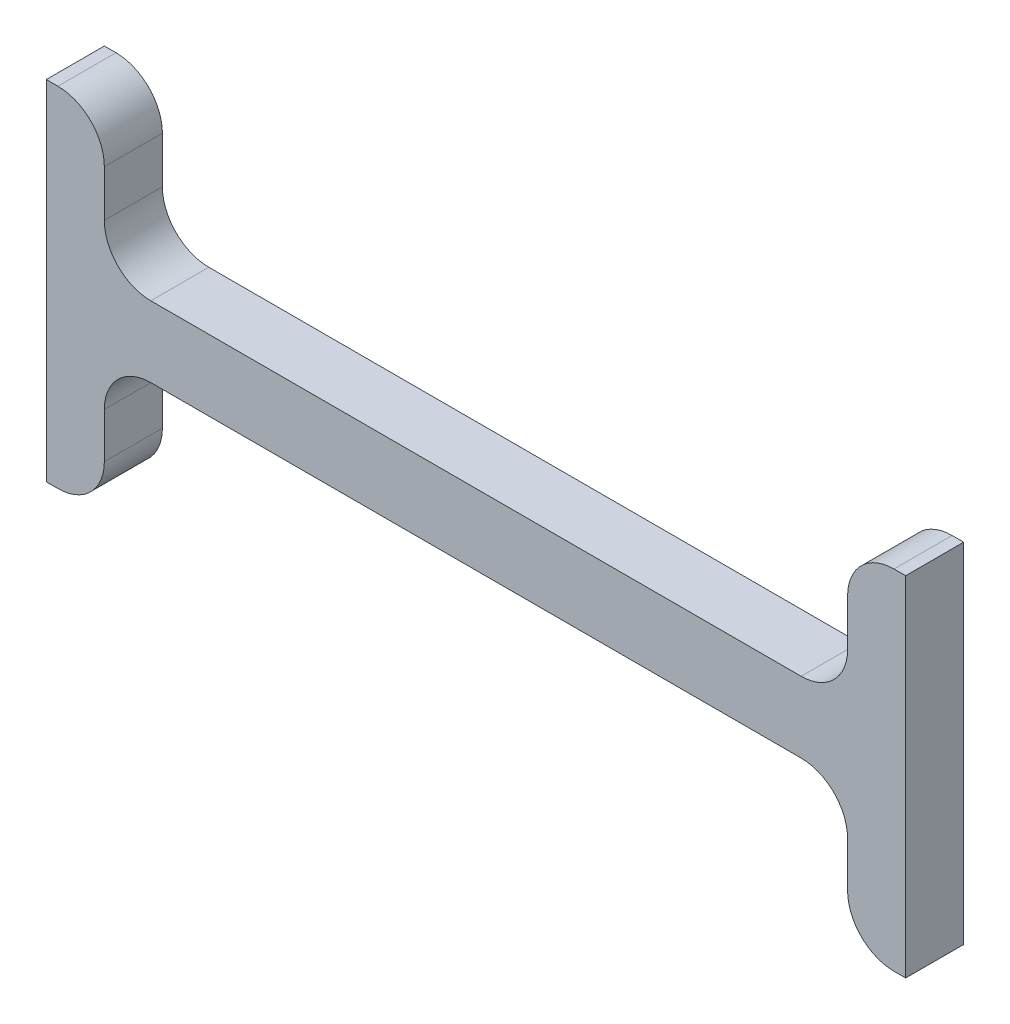
ISO-10303-21;
HEADER;
FILE_DESCRIPTION(('STEP AP214'),'2;1');
FILE_NAME('part.step','',(''),(''),'','','');
FILE_SCHEMA(('AUTOMOTIVE_DESIGN { 1 0 10303 214 1 1 1 1 }'));
ENDSEC;
DATA;
#1=APPLICATION_CONTEXT('core data for automotive mechanical design processes');
#2=APPLICATION_PROTOCOL_DEFINITION('international standard','automotive_design',2000,#1);
#3=PRODUCT_CONTEXT('',#1,'mechanical');
#4=PRODUCT('Part','Part','',(#3));
#5=PRODUCT_RELATED_PRODUCT_CATEGORY('part','',(#4));
#6=PRODUCT_DEFINITION_FORMATION('','',#4);
#7=PRODUCT_DEFINITION_CONTEXT('part definition',#1,'design');
#8=PRODUCT_DEFINITION('design','',#6,#7);
#9=PRODUCT_DEFINITION_SHAPE('','',#8);
#10=(LENGTH_UNIT() NAMED_UNIT(*) SI_UNIT(.MILLI.,.METRE.));
#11=(NAMED_UNIT(*) PLANE_ANGLE_UNIT() SI_UNIT($,.RADIAN.));
#12=(NAMED_UNIT(*) SI_UNIT($,.STERADIAN.) SOLID_ANGLE_UNIT());
#13=UNCERTAINTY_MEASURE_WITH_UNIT(LENGTH_MEASURE(1.E-05),#10,'distance_accuracy_value','');
#14=(GEOMETRIC_REPRESENTATION_CONTEXT(3) GLOBAL_UNCERTAINTY_ASSIGNED_CONTEXT((#13)) GLOBAL_UNIT_ASSIGNED_CONTEXT((#10,
#11,#12)) REPRESENTATION_CONTEXT('',''));
#15=CARTESIAN_POINT('',(0.,0.,0.));
#16=DIRECTION('',(0.,0.,1.));
#17=DIRECTION('',(1.,0.,0.));
#18=AXIS2_PLACEMENT_3D('',#15,#16,#17);
#19=CARTESIAN_POINT('',(1.26999999999996,0.,6.35));
#20=DIRECTION('',(0.,1.,0.));
#21=DIRECTION('',(0.,0.,1.));
#22=AXIS2_PLACEMENT_3D('',#19,#20,#21);
#23=PLANE('',#22);
#24=DIRECTION('',(1.,0.,0.));
#25=VECTOR('',#24,1.);
#26=CARTESIAN_POINT('',(1.26999999999996,0.,0.));
#27=LINE('',#26,#25);
#28=CARTESIAN_POINT('',(0.,0.,0.));
#29=VERTEX_POINT('',#28);
#30=CARTESIAN_POINT('',(1.26999999999997,0.,0.));
#31=VERTEX_POINT('',#30);
#32=EDGE_CURVE('E202',#29,#31,#27,.T.);
#33=ORIENTED_EDGE('',*,*,#32,.T.);
#34=DIRECTION('',(0.,0.,-1.));
#35=VECTOR('',#34,1.);
#36=CARTESIAN_POINT('',(1.26999999999997,0.,6.35));
#37=LINE('',#36,#35);
#38=CARTESIAN_POINT('',(1.26999999999997,0.,6.35));
#39=VERTEX_POINT('',#38);
#40=EDGE_CURVE('E11',#39,#31,#37,.T.);
#41=ORIENTED_EDGE('',*,*,#40,.F.);
#42=DIRECTION('',(1.,0.,0.));
#43=VECTOR('',#42,1.);
#44=CARTESIAN_POINT('',(1.26999999999996,0.,6.35));
#45=LINE('',#44,#43);
#46=CARTESIAN_POINT('',(0.,0.,6.35));
#47=VERTEX_POINT('',#46);
#48=EDGE_CURVE('E240',#47,#39,#45,.T.);
#49=ORIENTED_EDGE('',*,*,#48,.F.);
#50=DIRECTION('',(0.,0.,-1.));
#51=VECTOR('',#50,1.);
#52=CARTESIAN_POINT('',(0.,0.,6.35));
#53=LINE('',#52,#51);
#54=EDGE_CURVE('E198',#47,#29,#53,.T.);
#55=ORIENTED_EDGE('',*,*,#54,.T.);
#56=EDGE_LOOP('',(#33,#41,#49,#55));
#57=FACE_BOUND('',#56,.T.);
#58=ADVANCED_FACE('F34',(#57),#23,.F.);
#59=CARTESIAN_POINT('',(1.27,5.08,6.35));
#60=DIRECTION('',(0.,0.,-1.));
#61=DIRECTION('',(-1.,0.,0.));
#62=AXIS2_PLACEMENT_3D('',#59,#60,#61);
#63=CYLINDRICAL_SURFACE('',#62,5.08);
#64=CARTESIAN_POINT('',(1.27,5.08,0.));
#65=DIRECTION('',(0.,0.,1.));
#66=DIRECTION('',(-1.,0.,0.));
#67=AXIS2_PLACEMENT_3D('',#64,#65,#66);
#68=CIRCLE('',#67,5.08);
#69=CARTESIAN_POINT('',(6.35,5.08000000000003,0.));
#70=VERTEX_POINT('',#69);
#71=EDGE_CURVE('E205',#31,#70,#68,.T.);
#72=ORIENTED_EDGE('',*,*,#71,.T.);
#73=DIRECTION('',(0.,0.,-1.));
#74=VECTOR('',#73,1.);
#75=CARTESIAN_POINT('',(6.35,5.08000000000003,6.35));
#76=LINE('',#75,#74);
#77=CARTESIAN_POINT('',(6.35,5.08000000000003,6.35));
#78=VERTEX_POINT('',#77);
#79=EDGE_CURVE('E42',#78,#70,#76,.T.);
#80=ORIENTED_EDGE('',*,*,#79,.F.);
#81=CARTESIAN_POINT('',(1.27,5.08,6.35));
#82=DIRECTION('',(0.,0.,1.));
#83=DIRECTION('',(-1.,0.,0.));
#84=AXIS2_PLACEMENT_3D('',#81,#82,#83);
#85=CIRCLE('',#84,5.08);
#86=EDGE_CURVE('E129',#39,#78,#85,.T.);
#87=ORIENTED_EDGE('',*,*,#86,.F.);
#88=ORIENTED_EDGE('',*,*,#40,.T.);
#89=EDGE_LOOP('',(#72,#80,#87,#88));
#90=FACE_BOUND('',#89,.T.);
#91=ADVANCED_FACE('F358',(#90),#63,.T.);
#92=CARTESIAN_POINT('',(6.35,5.08000000000003,6.35));
#93=DIRECTION('',(-1.,0.,0.));
#94=DIRECTION('',(0.,0.,1.));
#95=AXIS2_PLACEMENT_3D('',#92,#93,#94);
#96=PLANE('',#95);
#97=DIRECTION('',(0.,1.,0.));
#98=VECTOR('',#97,1.);
#99=CARTESIAN_POINT('',(6.35,5.08000000000003,0.));
#100=LINE('',#99,#98);
#101=CARTESIAN_POINT('',(6.35,10.033,0.));
#102=VERTEX_POINT('',#101);
#103=EDGE_CURVE('E207',#70,#102,#100,.T.);
#104=ORIENTED_EDGE('',*,*,#103,.T.);
#105=DIRECTION('',(0.,0.,-1.));
#106=VECTOR('',#105,1.);
#107=CARTESIAN_POINT('',(6.35,10.033,6.35));
#108=LINE('',#107,#106);
#109=CARTESIAN_POINT('',(6.35,10.033,6.35));
#110=VERTEX_POINT('',#109);
#111=EDGE_CURVE('E283',#110,#102,#108,.T.);
#112=ORIENTED_EDGE('',*,*,#111,.F.);
#113=DIRECTION('',(0.,1.,0.));
#114=VECTOR('',#113,1.);
#115=CARTESIAN_POINT('',(6.35,5.08000000000003,6.35));
#116=LINE('',#115,#114);
#117=EDGE_CURVE('E291',#78,#110,#116,.T.);
#118=ORIENTED_EDGE('',*,*,#117,.F.);
#119=ORIENTED_EDGE('',*,*,#79,.T.);
#120=EDGE_LOOP('',(#104,#112,#118,#119));
#121=FACE_BOUND('',#120,.T.);
#122=ADVANCED_FACE('F289',(#121),#96,.F.);
#123=CARTESIAN_POINT('',(11.43,10.033,6.35));
#124=DIRECTION('',(0.,0.,-1.));
#125=DIRECTION('',(-1.,0.,0.));
#126=AXIS2_PLACEMENT_3D('',#123,#124,#125);
#127=CYLINDRICAL_SURFACE('',#126,5.08);
#128=CARTESIAN_POINT('',(11.43,10.033,0.));
#129=DIRECTION('',(0.,0.,-1.));
#130=DIRECTION('',(-1.,0.,0.));
#131=AXIS2_PLACEMENT_3D('',#128,#129,#130);
#132=CIRCLE('',#131,5.08);
#133=CARTESIAN_POINT('',(11.43,15.113,0.));
#134=VERTEX_POINT('',#133);
#135=EDGE_CURVE('E209',#102,#134,#132,.T.);
#136=ORIENTED_EDGE('',*,*,#135,.T.);
#137=DIRECTION('',(0.,0.,-1.));
#138=VECTOR('',#137,1.);
#139=CARTESIAN_POINT('',(11.43,15.113,6.35));
#140=LINE('',#139,#138);
#141=CARTESIAN_POINT('',(11.43,15.113,6.35));
#142=VERTEX_POINT('',#141);
#143=EDGE_CURVE('E280',#142,#134,#140,.T.);
#144=ORIENTED_EDGE('',*,*,#143,.F.);
#145=CARTESIAN_POINT('',(11.43,10.033,6.35));
#146=DIRECTION('',(0.,0.,-1.));
#147=DIRECTION('',(-1.,0.,0.));
#148=AXIS2_PLACEMENT_3D('',#145,#146,#147);
#149=CIRCLE('',#148,5.08);
#150=EDGE_CURVE('E309',#110,#142,#149,.T.);
#151=ORIENTED_EDGE('',*,*,#150,.F.);
#152=ORIENTED_EDGE('',*,*,#111,.T.);
#153=EDGE_LOOP('',(#136,#144,#151,#152));
#154=FACE_BOUND('',#153,.T.);
#155=ADVANCED_FACE('F300',(#154),#127,.F.);
#156=CARTESIAN_POINT('',(11.43,15.113,6.35));
#157=DIRECTION('',(0.,1.,0.));
#158=DIRECTION('',(-1.,0.,0.));
#159=AXIS2_PLACEMENT_3D('',#156,#157,#158);
#160=PLANE('',#159);
#161=DIRECTION('',(1.,0.,0.));
#162=VECTOR('',#161,1.);
#163=CARTESIAN_POINT('',(11.43,15.113,0.));
#164=LINE('',#163,#162);
#165=CARTESIAN_POINT('',(82.55,15.113,0.));
#166=VERTEX_POINT('',#165);
#167=EDGE_CURVE('E211',#134,#166,#164,.T.);
#168=ORIENTED_EDGE('',*,*,#167,.T.);
#169=DIRECTION('',(0.,0.,-1.));
#170=VECTOR('',#169,1.);
#171=CARTESIAN_POINT('',(82.55,15.113,6.35));
#172=LINE('',#171,#170);
#173=CARTESIAN_POINT('',(82.55,15.113,6.35));
#174=VERTEX_POINT('',#173);
#175=EDGE_CURVE('E277',#174,#166,#172,.T.);
#176=ORIENTED_EDGE('',*,*,#175,.F.);
#177=DIRECTION('',(1.,0.,0.));
#178=VECTOR('',#177,1.);
#179=CARTESIAN_POINT('',(11.43,15.113,6.35));
#180=LINE('',#179,#178);
#181=EDGE_CURVE('E306',#142,#174,#180,.T.);
#182=ORIENTED_EDGE('',*,*,#181,.F.);
#183=ORIENTED_EDGE('',*,*,#143,.T.);
#184=EDGE_LOOP('',(#168,#176,#182,#183));
#185=FACE_BOUND('',#184,.T.);
#186=ADVANCED_FACE('F304',(#185),#160,.F.);
#187=CARTESIAN_POINT('',(82.55,10.033,6.35));
#188=DIRECTION('',(0.,0.,-1.));
#189=DIRECTION('',(-1.,0.,0.));
#190=AXIS2_PLACEMENT_3D('',#187,#188,#189);
#191=CYLINDRICAL_SURFACE('',#190,5.08);
#192=CARTESIAN_POINT('',(82.55,10.033,0.));
#193=DIRECTION('',(0.,0.,-1.));
#194=DIRECTION('',(1.,0.,0.));
#195=AXIS2_PLACEMENT_3D('',#192,#193,#194);
#196=CIRCLE('',#195,5.08);
#197=CARTESIAN_POINT('',(87.63,10.033,0.));
#198=VERTEX_POINT('',#197);
#199=EDGE_CURVE('E213',#166,#198,#196,.T.);
#200=ORIENTED_EDGE('',*,*,#199,.T.);
#201=DIRECTION('',(0.,0.,-1.));
#202=VECTOR('',#201,1.);
#203=CARTESIAN_POINT('',(87.63,10.033,6.35));
#204=LINE('',#203,#202);
#205=CARTESIAN_POINT('',(87.63,10.033,6.35));
#206=VERTEX_POINT('',#205);
#207=EDGE_CURVE('E274',#206,#198,#204,.T.);
#208=ORIENTED_EDGE('',*,*,#207,.F.);
#209=CARTESIAN_POINT('',(82.55,10.033,6.35));
#210=DIRECTION('',(0.,0.,-1.));
#211=DIRECTION('',(1.,0.,0.));
#212=AXIS2_PLACEMENT_3D('',#209,#210,#211);
#213=CIRCLE('',#212,5.08);
#214=EDGE_CURVE('E308',#174,#206,#213,.T.);
#215=ORIENTED_EDGE('',*,*,#214,.F.);
#216=ORIENTED_EDGE('',*,*,#175,.T.);
#217=EDGE_LOOP('',(#200,#208,#215,#216));
#218=FACE_BOUND('',#217,.T.);
#219=ADVANCED_FACE('F371',(#218),#191,.F.);
#220=CARTESIAN_POINT('',(87.63,5.08000000000004,6.35));
#221=DIRECTION('',(1.,0.,0.));
#222=DIRECTION('',(0.,0.,-1.));
#223=AXIS2_PLACEMENT_3D('',#220,#221,#222);
#224=PLANE('',#223);
#225=DIRECTION('',(0.,-1.,0.));
#226=VECTOR('',#225,1.);
#227=CARTESIAN_POINT('',(87.63,5.08000000000004,0.));
#228=LINE('',#227,#226);
#229=CARTESIAN_POINT('',(87.63,5.08000000000004,0.));
#230=VERTEX_POINT('',#229);
#231=EDGE_CURVE('E215',#198,#230,#228,.T.);
#232=ORIENTED_EDGE('',*,*,#231,.T.);
#233=DIRECTION('',(0.,0.,-1.));
#234=VECTOR('',#233,1.);
#235=CARTESIAN_POINT('',(87.63,5.08000000000004,6.35));
#236=LINE('',#235,#234);
#237=CARTESIAN_POINT('',(87.63,5.08000000000004,6.35));
#238=VERTEX_POINT('',#237);
#239=EDGE_CURVE('E271',#238,#230,#236,.T.);
#240=ORIENTED_EDGE('',*,*,#239,.F.);
#241=DIRECTION('',(0.,-1.,0.));
#242=VECTOR('',#241,1.);
#243=CARTESIAN_POINT('',(87.63,5.08000000000004,6.35));
#244=LINE('',#243,#242);
#245=EDGE_CURVE('E311',#206,#238,#244,.T.);
#246=ORIENTED_EDGE('',*,*,#245,.F.);
#247=ORIENTED_EDGE('',*,*,#207,.T.);
#248=EDGE_LOOP('',(#232,#240,#246,#247));
#249=FACE_BOUND('',#248,.T.);
#250=ADVANCED_FACE('F374',(#249),#224,.F.);
#251=CARTESIAN_POINT('',(92.71,5.08,6.35));
#252=DIRECTION('',(0.,0.,-1.));
#253=DIRECTION('',(-1.,0.,0.));
#254=AXIS2_PLACEMENT_3D('',#251,#252,#253);
#255=CYLINDRICAL_SURFACE('',#254,5.08);
#256=CARTESIAN_POINT('',(92.71,5.08,0.));
#257=DIRECTION('',(0.,0.,1.));
#258=DIRECTION('',(1.,0.,0.));
#259=AXIS2_PLACEMENT_3D('',#256,#257,#258);
#260=CIRCLE('',#259,5.08);
#261=CARTESIAN_POINT('',(92.7100000000001,0.,0.));
#262=VERTEX_POINT('',#261);
#263=EDGE_CURVE('E217',#230,#262,#260,.T.);
#264=ORIENTED_EDGE('',*,*,#263,.T.);
#265=DIRECTION('',(0.,0.,-1.));
#266=VECTOR('',#265,1.);
#267=CARTESIAN_POINT('',(92.7100000000001,0.,6.35));
#268=LINE('',#267,#266);
#269=CARTESIAN_POINT('',(92.7100000000001,0.,6.35));
#270=VERTEX_POINT('',#269);
#271=EDGE_CURVE('E268',#270,#262,#268,.T.);
#272=ORIENTED_EDGE('',*,*,#271,.F.);
#273=CARTESIAN_POINT('',(92.71,5.08,6.35));
#274=DIRECTION('',(0.,0.,1.));
#275=DIRECTION('',(1.,0.,0.));
#276=AXIS2_PLACEMENT_3D('',#273,#274,#275);
#277=CIRCLE('',#276,5.08);
#278=EDGE_CURVE('E317',#238,#270,#277,.T.);
#279=ORIENTED_EDGE('',*,*,#278,.F.);
#280=ORIENTED_EDGE('',*,*,#239,.T.);
#281=EDGE_LOOP('',(#264,#272,#279,#280));
#282=FACE_BOUND('',#281,.T.);
#283=ADVANCED_FACE('F378',(#282),#255,.T.);
#284=CARTESIAN_POINT('',(92.7100000000001,0.,6.35));
#285=DIRECTION('',(0.,1.,0.));
#286=DIRECTION('',(0.,0.,1.));
#287=AXIS2_PLACEMENT_3D('',#284,#285,#286);
#288=PLANE('',#287);
#289=DIRECTION('',(1.,0.,0.));
#290=VECTOR('',#289,1.);
#291=CARTESIAN_POINT('',(92.7100000000001,0.,0.));
#292=LINE('',#291,#290);
#293=CARTESIAN_POINT('',(93.98,0.,0.));
#294=VERTEX_POINT('',#293);
#295=EDGE_CURVE('E219',#262,#294,#292,.T.);
#296=ORIENTED_EDGE('',*,*,#295,.T.);
#297=DIRECTION('',(0.,0.,-1.));
#298=VECTOR('',#297,1.);
#299=CARTESIAN_POINT('',(93.98,0.,6.35));
#300=LINE('',#299,#298);
#301=CARTESIAN_POINT('',(93.98,0.,6.35));
#302=VERTEX_POINT('',#301);
#303=EDGE_CURVE('E265',#302,#294,#300,.T.);
#304=ORIENTED_EDGE('',*,*,#303,.F.);
#305=DIRECTION('',(1.,0.,0.));
#306=VECTOR('',#305,1.);
#307=CARTESIAN_POINT('',(92.7100000000001,0.,6.35));
#308=LINE('',#307,#306);
#309=EDGE_CURVE('E319',#270,#302,#308,.T.);
#310=ORIENTED_EDGE('',*,*,#309,.F.);
#311=ORIENTED_EDGE('',*,*,#271,.T.);
#312=EDGE_LOOP('',(#296,#304,#310,#311));
#313=FACE_BOUND('',#312,.T.);
#314=ADVANCED_FACE('F382',(#313),#288,.F.);
#315=CARTESIAN_POINT('',(93.98,0.,6.35));
#316=DIRECTION('',(-1.,0.,0.));
#317=DIRECTION('',(0.,0.,1.));
#318=AXIS2_PLACEMENT_3D('',#315,#316,#317);
#319=PLANE('',#318);
#320=DIRECTION('',(0.,1.,0.));
#321=VECTOR('',#320,1.);
#322=CARTESIAN_POINT('',(93.98,0.,0.));
#323=LINE('',#322,#321);
#324=CARTESIAN_POINT('',(93.98,38.1,0.));
#325=VERTEX_POINT('',#324);
#326=EDGE_CURVE('E221',#294,#325,#323,.T.);
#327=ORIENTED_EDGE('',*,*,#326,.T.);
#328=DIRECTION('',(0.,0.,-1.));
#329=VECTOR('',#328,1.);
#330=CARTESIAN_POINT('',(93.98,38.1,6.35));
#331=LINE('',#330,#329);
#332=CARTESIAN_POINT('',(93.98,38.1,6.35));
#333=VERTEX_POINT('',#332);
#334=EDGE_CURVE('E262',#333,#325,#331,.T.);
#335=ORIENTED_EDGE('',*,*,#334,.F.);
#336=DIRECTION('',(0.,1.,0.));
#337=VECTOR('',#336,1.);
#338=CARTESIAN_POINT('',(93.98,0.,6.35));
#339=LINE('',#338,#337);
#340=EDGE_CURVE('E321',#302,#333,#339,.T.);
#341=ORIENTED_EDGE('',*,*,#340,.F.);
#342=ORIENTED_EDGE('',*,*,#303,.T.);
#343=EDGE_LOOP('',(#327,#335,#341,#342));
#344=FACE_BOUND('',#343,.T.);
#345=ADVANCED_FACE('F386',(#344),#319,.F.);
#346=CARTESIAN_POINT('',(93.98,38.1,6.35));
#347=DIRECTION('',(0.,-1.,0.));
#348=DIRECTION('',(0.,0.,-1.));
#349=AXIS2_PLACEMENT_3D('',#346,#347,#348);
#350=PLANE('',#349);
#351=DIRECTION('',(-1.,0.,0.));
#352=VECTOR('',#351,1.);
#353=CARTESIAN_POINT('',(93.98,38.1,0.));
#354=LINE('',#353,#352);
#355=CARTESIAN_POINT('',(92.7100000000001,38.1,0.));
#356=VERTEX_POINT('',#355);
#357=EDGE_CURVE('E223',#325,#356,#354,.T.);
#358=ORIENTED_EDGE('',*,*,#357,.T.);
#359=DIRECTION('',(0.,0.,-1.));
#360=VECTOR('',#359,1.);
#361=CARTESIAN_POINT('',(92.7100000000001,38.1,6.35));
#362=LINE('',#361,#360);
#363=CARTESIAN_POINT('',(92.7100000000001,38.1,6.35));
#364=VERTEX_POINT('',#363);
#365=EDGE_CURVE('E259',#364,#356,#362,.T.);
#366=ORIENTED_EDGE('',*,*,#365,.F.);
#367=DIRECTION('',(-1.,0.,0.));
#368=VECTOR('',#367,1.);
#369=CARTESIAN_POINT('',(93.98,38.1,6.35));
#370=LINE('',#369,#368);
#371=EDGE_CURVE('E323',#333,#364,#370,.T.);
#372=ORIENTED_EDGE('',*,*,#371,.F.);
#373=ORIENTED_EDGE('',*,*,#334,.T.);
#374=EDGE_LOOP('',(#358,#366,#372,#373));
#375=FACE_BOUND('',#374,.T.);
#376=ADVANCED_FACE('F390',(#375),#350,.F.);
#377=CARTESIAN_POINT('',(92.71,33.02,6.35));
#378=DIRECTION('',(0.,0.,-1.));
#379=DIRECTION('',(-1.,0.,0.));
#380=AXIS2_PLACEMENT_3D('',#377,#378,#379);
#381=CYLINDRICAL_SURFACE('',#380,5.08);
#382=CARTESIAN_POINT('',(92.71,33.02,0.));
#383=DIRECTION('',(0.,0.,1.));
#384=DIRECTION('',(-1.,0.,0.));
#385=AXIS2_PLACEMENT_3D('',#382,#383,#384);
#386=CIRCLE('',#385,5.08);
#387=CARTESIAN_POINT('',(87.63,33.02,0.));
#388=VERTEX_POINT('',#387);
#389=EDGE_CURVE('E225',#356,#388,#386,.T.);
#390=ORIENTED_EDGE('',*,*,#389,.T.);
#391=DIRECTION('',(0.,0.,-1.));
#392=VECTOR('',#391,1.);
#393=CARTESIAN_POINT('',(87.63,33.02,6.35));
#394=LINE('',#393,#392);
#395=CARTESIAN_POINT('',(87.63,33.02,6.35));
#396=VERTEX_POINT('',#395);
#397=EDGE_CURVE('E256',#396,#388,#394,.T.);
#398=ORIENTED_EDGE('',*,*,#397,.F.);
#399=CARTESIAN_POINT('',(92.71,33.02,6.35));
#400=DIRECTION('',(0.,0.,1.));
#401=DIRECTION('',(-1.,0.,0.));
#402=AXIS2_PLACEMENT_3D('',#399,#400,#401);
#403=CIRCLE('',#402,5.08);
#404=EDGE_CURVE('E325',#364,#396,#403,.T.);
#405=ORIENTED_EDGE('',*,*,#404,.F.);
#406=ORIENTED_EDGE('',*,*,#365,.T.);
#407=EDGE_LOOP('',(#390,#398,#405,#406));
#408=FACE_BOUND('',#407,.T.);
#409=ADVANCED_FACE('F394',(#408),#381,.T.);
#410=CARTESIAN_POINT('',(87.63,27.94,6.35));
#411=DIRECTION('',(1.,0.,0.));
#412=DIRECTION('',(0.,0.,-1.));
#413=AXIS2_PLACEMENT_3D('',#410,#411,#412);
#414=PLANE('',#413);
#415=DIRECTION('',(0.,-1.,0.));
#416=VECTOR('',#415,1.);
#417=CARTESIAN_POINT('',(87.63,27.94,0.));
#418=LINE('',#417,#416);
#419=CARTESIAN_POINT('',(87.63,27.94,0.));
#420=VERTEX_POINT('',#419);
#421=EDGE_CURVE('E227',#388,#420,#418,.T.);
#422=ORIENTED_EDGE('',*,*,#421,.T.);
#423=DIRECTION('',(0.,0.,-1.));
#424=VECTOR('',#423,1.);
#425=CARTESIAN_POINT('',(87.63,27.94,6.35));
#426=LINE('',#425,#424);
#427=CARTESIAN_POINT('',(87.63,27.94,6.35));
#428=VERTEX_POINT('',#427);
#429=EDGE_CURVE('E253',#428,#420,#426,.T.);
#430=ORIENTED_EDGE('',*,*,#429,.F.);
#431=DIRECTION('',(0.,-1.,0.));
#432=VECTOR('',#431,1.);
#433=CARTESIAN_POINT('',(87.63,27.94,6.35));
#434=LINE('',#433,#432);
#435=EDGE_CURVE('E327',#396,#428,#434,.T.);
#436=ORIENTED_EDGE('',*,*,#435,.F.);
#437=ORIENTED_EDGE('',*,*,#397,.T.);
#438=EDGE_LOOP('',(#422,#430,#436,#437));
#439=FACE_BOUND('',#438,.T.);
#440=ADVANCED_FACE('F398',(#439),#414,.F.);
#441=CARTESIAN_POINT('',(82.55,27.94,6.35));
#442=DIRECTION('',(0.,0.,-1.));
#443=DIRECTION('',(-1.,0.,0.));
#444=AXIS2_PLACEMENT_3D('',#441,#442,#443);
#445=CYLINDRICAL_SURFACE('',#444,5.08);
#446=CARTESIAN_POINT('',(82.55,27.94,0.));
#447=DIRECTION('',(0.,0.,-1.));
#448=DIRECTION('',(-1.,0.,0.));
#449=AXIS2_PLACEMENT_3D('',#446,#447,#448);
#450=CIRCLE('',#449,5.08);
#451=CARTESIAN_POINT('',(82.55,22.86,0.));
#452=VERTEX_POINT('',#451);
#453=EDGE_CURVE('E229',#420,#452,#450,.T.);
#454=ORIENTED_EDGE('',*,*,#453,.T.);
#455=DIRECTION('',(0.,0.,-1.));
#456=VECTOR('',#455,1.);
#457=CARTESIAN_POINT('',(82.55,22.86,6.35));
#458=LINE('',#457,#456);
#459=CARTESIAN_POINT('',(82.55,22.86,6.35));
#460=VERTEX_POINT('',#459);
#461=EDGE_CURVE('E250',#460,#452,#458,.T.);
#462=ORIENTED_EDGE('',*,*,#461,.F.);
#463=CARTESIAN_POINT('',(82.55,27.94,6.35));
#464=DIRECTION('',(0.,0.,-1.));
#465=DIRECTION('',(-1.,0.,0.));
#466=AXIS2_PLACEMENT_3D('',#463,#464,#465);
#467=CIRCLE('',#466,5.08);
#468=EDGE_CURVE('E329',#428,#460,#467,.T.);
#469=ORIENTED_EDGE('',*,*,#468,.F.);
#470=ORIENTED_EDGE('',*,*,#429,.T.);
#471=EDGE_LOOP('',(#454,#462,#469,#470));
#472=FACE_BOUND('',#471,.T.);
#473=ADVANCED_FACE('F402',(#472),#445,.F.);
#474=CARTESIAN_POINT('',(11.43,22.86,6.35));
#475=DIRECTION('',(0.,-1.,0.));
#476=DIRECTION('',(1.,0.,0.));
#477=AXIS2_PLACEMENT_3D('',#474,#475,#476);
#478=PLANE('',#477);
#479=DIRECTION('',(-1.,0.,0.));
#480=VECTOR('',#479,1.);
#481=CARTESIAN_POINT('',(11.43,22.86,0.));
#482=LINE('',#481,#480);
#483=CARTESIAN_POINT('',(11.43,22.86,0.));
#484=VERTEX_POINT('',#483);
#485=EDGE_CURVE('E231',#452,#484,#482,.T.);
#486=ORIENTED_EDGE('',*,*,#485,.T.);
#487=DIRECTION('',(0.,0.,-1.));
#488=VECTOR('',#487,1.);
#489=CARTESIAN_POINT('',(11.43,22.86,6.35));
#490=LINE('',#489,#488);
#491=CARTESIAN_POINT('',(11.43,22.86,6.35));
#492=VERTEX_POINT('',#491);
#493=EDGE_CURVE('E247',#492,#484,#490,.T.);
#494=ORIENTED_EDGE('',*,*,#493,.F.);
#495=DIRECTION('',(-1.,0.,0.));
#496=VECTOR('',#495,1.);
#497=CARTESIAN_POINT('',(11.43,22.86,6.35));
#498=LINE('',#497,#496);
#499=EDGE_CURVE('E331',#460,#492,#498,.T.);
#500=ORIENTED_EDGE('',*,*,#499,.F.);
#501=ORIENTED_EDGE('',*,*,#461,.T.);
#502=EDGE_LOOP('',(#486,#494,#500,#501));
#503=FACE_BOUND('',#502,.T.);
#504=ADVANCED_FACE('F406',(#503),#478,.F.);
#505=CARTESIAN_POINT('',(11.43,27.94,6.35));
#506=DIRECTION('',(0.,0.,-1.));
#507=DIRECTION('',(-1.,0.,0.));
#508=AXIS2_PLACEMENT_3D('',#505,#506,#507);
#509=CYLINDRICAL_SURFACE('',#508,5.08);
#510=CARTESIAN_POINT('',(11.43,27.94,0.));
#511=DIRECTION('',(0.,0.,-1.));
#512=DIRECTION('',(-1.,0.,0.));
#513=AXIS2_PLACEMENT_3D('',#510,#511,#512);
#514=CIRCLE('',#513,5.08);
#515=CARTESIAN_POINT('',(6.35,27.94,0.));
#516=VERTEX_POINT('',#515);
#517=EDGE_CURVE('E233',#484,#516,#514,.T.);
#518=ORIENTED_EDGE('',*,*,#517,.T.);
#519=DIRECTION('',(0.,0.,-1.));
#520=VECTOR('',#519,1.);
#521=CARTESIAN_POINT('',(6.35,27.94,6.35));
#522=LINE('',#521,#520);
#523=CARTESIAN_POINT('',(6.35,27.94,6.35));
#524=VERTEX_POINT('',#523);
#525=EDGE_CURVE('E244',#524,#516,#522,.T.);
#526=ORIENTED_EDGE('',*,*,#525,.F.);
#527=CARTESIAN_POINT('',(11.43,27.94,6.35));
#528=DIRECTION('',(0.,0.,-1.));
#529=DIRECTION('',(-1.,0.,0.));
#530=AXIS2_PLACEMENT_3D('',#527,#528,#529);
#531=CIRCLE('',#530,5.08);
#532=EDGE_CURVE('E333',#492,#524,#531,.T.);
#533=ORIENTED_EDGE('',*,*,#532,.F.);
#534=ORIENTED_EDGE('',*,*,#493,.T.);
#535=EDGE_LOOP('',(#518,#526,#533,#534));
#536=FACE_BOUND('',#535,.T.);
#537=ADVANCED_FACE('F339',(#536),#509,.F.);
#538=CARTESIAN_POINT('',(6.35,27.94,6.35));
#539=DIRECTION('',(-1.,0.,0.));
#540=DIRECTION('',(0.,0.,1.));
#541=AXIS2_PLACEMENT_3D('',#538,#539,#540);
#542=PLANE('',#541);
#543=DIRECTION('',(0.,1.,0.));
#544=VECTOR('',#543,1.);
#545=CARTESIAN_POINT('',(6.35,27.94,0.));
#546=LINE('',#545,#544);
#547=CARTESIAN_POINT('',(6.35,33.02,0.));
#548=VERTEX_POINT('',#547);
#549=EDGE_CURVE('E235',#516,#548,#546,.T.);
#550=ORIENTED_EDGE('',*,*,#549,.T.);
#551=DIRECTION('',(0.,0.,-1.));
#552=VECTOR('',#551,1.);
#553=CARTESIAN_POINT('',(6.35,33.02,6.35));
#554=LINE('',#553,#552);
#555=CARTESIAN_POINT('',(6.35,33.02,6.35));
#556=VERTEX_POINT('',#555);
#557=EDGE_CURVE('E193',#556,#548,#554,.T.);
#558=ORIENTED_EDGE('',*,*,#557,.F.);
#559=DIRECTION('',(0.,1.,0.));
#560=VECTOR('',#559,1.);
#561=CARTESIAN_POINT('',(6.35,27.94,6.35));
#562=LINE('',#561,#560);
#563=EDGE_CURVE('E184',#524,#556,#562,.T.);
#564=ORIENTED_EDGE('',*,*,#563,.F.);
#565=ORIENTED_EDGE('',*,*,#525,.T.);
#566=EDGE_LOOP('',(#550,#558,#564,#565));
#567=FACE_BOUND('',#566,.T.);
#568=ADVANCED_FACE('F343',(#567),#542,.F.);
#569=CARTESIAN_POINT('',(1.27,33.02,6.35));
#570=DIRECTION('',(0.,0.,-1.));
#571=DIRECTION('',(-1.,0.,0.));
#572=AXIS2_PLACEMENT_3D('',#569,#570,#571);
#573=CYLINDRICAL_SURFACE('',#572,5.08);
#574=CARTESIAN_POINT('',(1.27,33.02,0.));
#575=DIRECTION('',(0.,0.,1.));
#576=DIRECTION('',(1.,0.,0.));
#577=AXIS2_PLACEMENT_3D('',#574,#575,#576);
#578=CIRCLE('',#577,5.08);
#579=CARTESIAN_POINT('',(1.26999999999996,38.1,0.));
#580=VERTEX_POINT('',#579);
#581=EDGE_CURVE('E192',#548,#580,#578,.T.);
#582=ORIENTED_EDGE('',*,*,#581,.T.);
#583=DIRECTION('',(0.,0.,-1.));
#584=VECTOR('',#583,1.);
#585=CARTESIAN_POINT('',(1.26999999999996,38.1,6.35));
#586=LINE('',#585,#584);
#587=CARTESIAN_POINT('',(1.26999999999996,38.1,6.35));
#588=VERTEX_POINT('',#587);
#589=EDGE_CURVE('E189',#588,#580,#586,.T.);
#590=ORIENTED_EDGE('',*,*,#589,.F.);
#591=CARTESIAN_POINT('',(1.27,33.02,6.35));
#592=DIRECTION('',(0.,0.,1.));
#593=DIRECTION('',(1.,0.,0.));
#594=AXIS2_PLACEMENT_3D('',#591,#592,#593);
#595=CIRCLE('',#594,5.08);
#596=EDGE_CURVE('E178',#556,#588,#595,.T.);
#597=ORIENTED_EDGE('',*,*,#596,.F.);
#598=ORIENTED_EDGE('',*,*,#557,.T.);
#599=EDGE_LOOP('',(#582,#590,#597,#598));
#600=FACE_BOUND('',#599,.T.);
#601=ADVANCED_FACE('F190',(#600),#573,.T.);
#602=CARTESIAN_POINT('',(0.,38.1,6.35));
#603=DIRECTION('',(0.,-1.,0.));
#604=DIRECTION('',(0.,0.,-1.));
#605=AXIS2_PLACEMENT_3D('',#602,#603,#604);
#606=PLANE('',#605);
#607=DIRECTION('',(-1.,0.,0.));
#608=VECTOR('',#607,1.);
#609=CARTESIAN_POINT('',(0.,38.1,0.));
#610=LINE('',#609,#608);
#611=CARTESIAN_POINT('',(0.,38.1,0.));
#612=VERTEX_POINT('',#611);
#613=EDGE_CURVE('E115',#580,#612,#610,.T.);
#614=ORIENTED_EDGE('',*,*,#613,.T.);
#615=DIRECTION('',(0.,0.,-1.));
#616=VECTOR('',#615,1.);
#617=CARTESIAN_POINT('',(0.,38.1,6.35));
#618=LINE('',#617,#616);
#619=CARTESIAN_POINT('',(0.,38.1,6.35));
#620=VERTEX_POINT('',#619);
#621=EDGE_CURVE('E194',#620,#612,#618,.T.);
#622=ORIENTED_EDGE('',*,*,#621,.F.);
#623=DIRECTION('',(-1.,0.,0.));
#624=VECTOR('',#623,1.);
#625=CARTESIAN_POINT('',(0.,38.1,6.35));
#626=LINE('',#625,#624);
#627=EDGE_CURVE('E182',#588,#620,#626,.T.);
#628=ORIENTED_EDGE('',*,*,#627,.F.);
#629=ORIENTED_EDGE('',*,*,#589,.T.);
#630=EDGE_LOOP('',(#614,#622,#628,#629));
#631=FACE_BOUND('',#630,.T.);
#632=ADVANCED_FACE('F196',(#631),#606,.F.);
#633=CARTESIAN_POINT('',(0.,0.,6.35));
#634=DIRECTION('',(1.,0.,0.));
#635=DIRECTION('',(0.,0.,-1.));
#636=AXIS2_PLACEMENT_3D('',#633,#634,#635);
#637=PLANE('',#636);
#638=DIRECTION('',(0.,-1.,0.));
#639=VECTOR('',#638,1.);
#640=CARTESIAN_POINT('',(0.,0.,0.));
#641=LINE('',#640,#639);
#642=EDGE_CURVE('E121',#612,#29,#641,.T.);
#643=ORIENTED_EDGE('',*,*,#642,.T.);
#644=ORIENTED_EDGE('',*,*,#54,.F.);
#645=DIRECTION('',(0.,-1.,0.));
#646=VECTOR('',#645,1.);
#647=CARTESIAN_POINT('',(0.,0.,6.35));
#648=LINE('',#647,#646);
#649=EDGE_CURVE('E50',#620,#47,#648,.T.);
#650=ORIENTED_EDGE('',*,*,#649,.F.);
#651=ORIENTED_EDGE('',*,*,#621,.T.);
#652=EDGE_LOOP('',(#643,#644,#650,#651));
#653=FACE_BOUND('',#652,.T.);
#654=ADVANCED_FACE('F347',(#653),#637,.F.);
#655=CARTESIAN_POINT('',(1.27,33.02,6.35));
#656=DIRECTION('',(0.,0.,1.));
#657=DIRECTION('',(1.,0.,0.));
#658=AXIS2_PLACEMENT_3D('',#655,#656,#657);
#659=PLANE('',#658);
#660=ORIENTED_EDGE('',*,*,#48,.T.);
#661=ORIENTED_EDGE('',*,*,#86,.T.);
#662=ORIENTED_EDGE('',*,*,#117,.T.);
#663=ORIENTED_EDGE('',*,*,#150,.T.);
#664=ORIENTED_EDGE('',*,*,#181,.T.);
#665=ORIENTED_EDGE('',*,*,#214,.T.);
#666=ORIENTED_EDGE('',*,*,#245,.T.);
#667=ORIENTED_EDGE('',*,*,#278,.T.);
#668=ORIENTED_EDGE('',*,*,#309,.T.);
#669=ORIENTED_EDGE('',*,*,#340,.T.);
#670=ORIENTED_EDGE('',*,*,#371,.T.);
#671=ORIENTED_EDGE('',*,*,#404,.T.);
#672=ORIENTED_EDGE('',*,*,#435,.T.);
#673=ORIENTED_EDGE('',*,*,#468,.T.);
#674=ORIENTED_EDGE('',*,*,#499,.T.);
#675=ORIENTED_EDGE('',*,*,#532,.T.);
#676=ORIENTED_EDGE('',*,*,#563,.T.);
#677=ORIENTED_EDGE('',*,*,#596,.T.);
#678=ORIENTED_EDGE('',*,*,#627,.T.);
#679=ORIENTED_EDGE('',*,*,#649,.T.);
#680=EDGE_LOOP('',(#660,#661,#662,#663,#664,#665,#666,#667,#668,#669,#670,#671,#672,#673,#674,
#675,#676,#677,#678,#679));
#681=FACE_BOUND('',#680,.T.);
#682=ADVANCED_FACE('F180',(#681),#659,.T.);
#683=CARTESIAN_POINT('',(1.27,33.02,0.));
#684=DIRECTION('',(0.,0.,1.));
#685=DIRECTION('',(1.,0.,0.));
#686=AXIS2_PLACEMENT_3D('',#683,#684,#685);
#687=PLANE('',#686);
#688=ORIENTED_EDGE('',*,*,#32,.F.);
#689=ORIENTED_EDGE('',*,*,#642,.F.);
#690=ORIENTED_EDGE('',*,*,#613,.F.);
#691=ORIENTED_EDGE('',*,*,#581,.F.);
#692=ORIENTED_EDGE('',*,*,#549,.F.);
#693=ORIENTED_EDGE('',*,*,#517,.F.);
#694=ORIENTED_EDGE('',*,*,#485,.F.);
#695=ORIENTED_EDGE('',*,*,#453,.F.);
#696=ORIENTED_EDGE('',*,*,#421,.F.);
#697=ORIENTED_EDGE('',*,*,#389,.F.);
#698=ORIENTED_EDGE('',*,*,#357,.F.);
#699=ORIENTED_EDGE('',*,*,#326,.F.);
#700=ORIENTED_EDGE('',*,*,#295,.F.);
#701=ORIENTED_EDGE('',*,*,#263,.F.);
#702=ORIENTED_EDGE('',*,*,#231,.F.);
#703=ORIENTED_EDGE('',*,*,#199,.F.);
#704=ORIENTED_EDGE('',*,*,#167,.F.);
#705=ORIENTED_EDGE('',*,*,#135,.F.);
#706=ORIENTED_EDGE('',*,*,#103,.F.);
#707=ORIENTED_EDGE('',*,*,#71,.F.);
#708=EDGE_LOOP('',(#688,#689,#690,#691,#692,#693,#694,#695,#696,#697,#698,#699,#700,#701,#702,
#703,#704,#705,#706,#707));
#709=FACE_BOUND('',#708,.T.);
#710=ADVANCED_FACE('F295',(#709),#687,.F.);
#711=CLOSED_SHELL('',(#58,#91,#122,#155,#186,#219,#250,#283,#314,#345,#376,#409,#440,#473,#504,
#537,#568,#601,#632,#654,#682,#710));
#712=MANIFOLD_SOLID_BREP('B2',#711);
#713=ADVANCED_BREP_SHAPE_REPRESENTATION('',(#18,#712),#14);
#714=SHAPE_DEFINITION_REPRESENTATION(#9,#713);
ENDSEC;
END-ISO-10303-21;
